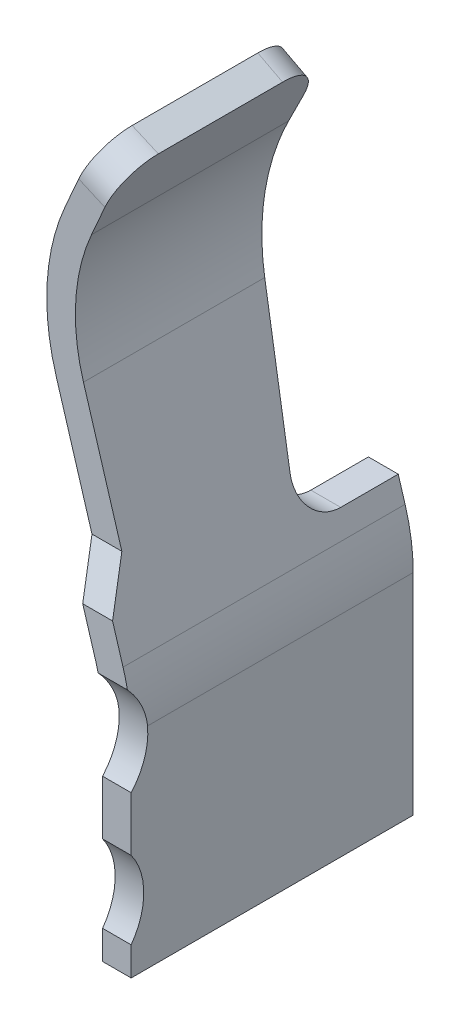
ISO-10303-21;
HEADER;
FILE_DESCRIPTION(('STEP AP214'),'2;1');
FILE_NAME('part.step','',(''),(''),'','','');
FILE_SCHEMA(('AUTOMOTIVE_DESIGN { 1 0 10303 214 1 1 1 1 }'));
ENDSEC;
DATA;
#1=APPLICATION_CONTEXT('core data for automotive mechanical design processes');
#2=APPLICATION_PROTOCOL_DEFINITION('international standard','automotive_design',2000,#1);
#3=PRODUCT_CONTEXT('',#1,'mechanical');
#4=PRODUCT('Part','Part','',(#3));
#5=PRODUCT_RELATED_PRODUCT_CATEGORY('part','',(#4));
#6=PRODUCT_DEFINITION_FORMATION('','',#4);
#7=PRODUCT_DEFINITION_CONTEXT('part definition',#1,'design');
#8=PRODUCT_DEFINITION('design','',#6,#7);
#9=PRODUCT_DEFINITION_SHAPE('','',#8);
#10=(LENGTH_UNIT() NAMED_UNIT(*) SI_UNIT(.MILLI.,.METRE.));
#11=(NAMED_UNIT(*) PLANE_ANGLE_UNIT() SI_UNIT($,.RADIAN.));
#12=(NAMED_UNIT(*) SI_UNIT($,.STERADIAN.) SOLID_ANGLE_UNIT());
#13=UNCERTAINTY_MEASURE_WITH_UNIT(LENGTH_MEASURE(1.E-05),#10,'distance_accuracy_value','');
#14=(GEOMETRIC_REPRESENTATION_CONTEXT(3) GLOBAL_UNCERTAINTY_ASSIGNED_CONTEXT((#13)) GLOBAL_UNIT_ASSIGNED_CONTEXT((#10,
#11,#12)) REPRESENTATION_CONTEXT('',''));
#15=CARTESIAN_POINT('',(0.,0.,0.));
#16=DIRECTION('',(0.,0.,1.));
#17=DIRECTION('',(1.,0.,0.));
#18=AXIS2_PLACEMENT_3D('',#15,#16,#17);
#19=CARTESIAN_POINT('',(1.87844493318108,3.52330708865174,0.423604352914839));
#20=DIRECTION('',(0.915327071470027,-0.402711251685503,0.));
#21=DIRECTION('',(0.402711251685503,0.915327071470027,0.));
#22=AXIS2_PLACEMENT_3D('',#19,#20,#21);
#23=CYLINDRICAL_SURFACE('',#22,0.2);
#24=CARTESIAN_POINT('',(1.87844493318108,3.52330708865174,0.423604352914839));
#25=DIRECTION('',(-0.915327071470028,0.4027112516855,0.));
#26=DIRECTION('',(0.4027112516855,0.915327071470028,0.));
#27=AXIS2_PLACEMENT_3D('',#24,#25,#26);
#28=CIRCLE('',#27,0.2);
#29=CARTESIAN_POINT('',(1.87844493318108,3.52330708865174,0.623604352914839));
#30=VERTEX_POINT('',#29);
#31=CARTESIAN_POINT('',(1.95898718351818,3.70637250294574,0.423604352914839));
#32=VERTEX_POINT('',#31);
#33=EDGE_CURVE('E527',#30,#32,#28,.T.);
#34=ORIENTED_EDGE('',*,*,#33,.F.);
#35=DIRECTION('',(-0.915327071470027,0.402711251685503,0.));
#36=VECTOR('',#35,1.);
#37=CARTESIAN_POINT('',(-22.7315059297134,14.3508073613119,0.623604352914805));
#38=LINE('',#37,#36);
#39=CARTESIAN_POINT('',(2.01574399390158,3.46290040089891,0.623604352914839));
#40=VERTEX_POINT('',#39);
#41=EDGE_CURVE('E27',#40,#30,#38,.T.);
#42=ORIENTED_EDGE('',*,*,#41,.F.);
#43=CARTESIAN_POINT('',(2.01574399390158,3.46290040089891,0.423604352914839));
#44=DIRECTION('',(0.915327071470028,-0.4027112516855,0.));
#45=DIRECTION('',(-0.402711251685501,-0.915327071470028,0.));
#46=AXIS2_PLACEMENT_3D('',#43,#44,#45);
#47=CIRCLE('',#46,0.2);
#48=CARTESIAN_POINT('',(2.09628624423868,3.64596581519291,0.423604352914839));
#49=VERTEX_POINT('',#48);
#50=EDGE_CURVE('E443',#49,#40,#47,.T.);
#51=ORIENTED_EDGE('',*,*,#50,.F.);
#52=DIRECTION('',(0.915327071470027,-0.402711251685503,0.));
#53=VECTOR('',#52,1.);
#54=CARTESIAN_POINT('',(1.95898718351818,3.70637250294574,0.423604352914839));
#55=LINE('',#54,#53);
#56=EDGE_CURVE('E492',#32,#49,#55,.T.);
#57=ORIENTED_EDGE('',*,*,#56,.F.);
#58=EDGE_LOOP('',(#34,#42,#51,#57));
#59=FACE_BOUND('',#58,.T.);
#60=ADVANCED_FACE('F16',(#59),#23,.T.);
#61=CARTESIAN_POINT('',(1.85613725867001,3.53312166947706,-0.236832722369337));
#62=DIRECTION('',(-0.914255270392898,0.402239697454473,-0.0483789866630451));
#63=DIRECTION('',(-0.402711251685503,-0.915327071470027,0.));
#64=AXIS2_PLACEMENT_3D('',#61,#62,#63);
#65=CYLINDRICAL_SURFACE('',#64,0.2);
#66=CARTESIAN_POINT('',(2.00694053804578,3.44289092405021,-0.427421697659668));
#67=CARTESIAN_POINT('',(2.05801746519236,3.55898426375477,-0.441384710680955));
#68=CARTESIAN_POINT('',(2.09628624423868,3.64596581519291,-0.356133634256613));
#69=CARTESIAN_POINT('',(2.09628624423868,3.64596581519291,-0.228386927890316));
#70=(BOUNDED_CURVE() B_SPLINE_CURVE(3,(#66,#67,#68,#69),.UNSPECIFIED.,.F.,
.F.) B_SPLINE_CURVE_WITH_KNOTS((4,4),(6.17366415670651,7.85398163397443),
.UNSPECIFIED.) CURVE() GEOMETRIC_REPRESENTATION_ITEM() RATIONAL_B_SPLINE_CURVE((1.,
0.77822974253387,0.77822974253387,1.)) REPRESENTATION_ITEM(''));
#71=CARTESIAN_POINT('',(2.00694053804578,3.44289092405021,-0.427421697659668));
#72=VERTEX_POINT('',#71);
#73=CARTESIAN_POINT('',(2.09628624423868,3.64596581519291,-0.228386927890316));
#74=VERTEX_POINT('',#73);
#75=EDGE_CURVE('E449',#72,#74,#70,.T.);
#76=ORIENTED_EDGE('',*,*,#75,.F.);
#77=DIRECTION('',(0.914255270392898,-0.402239697454473,0.0483789866630451));
#78=VECTOR('',#77,1.);
#79=CARTESIAN_POINT('',(-23.331852655037,14.5910558161891,-1.76825633941021));
#80=LINE('',#79,#78);
#81=CARTESIAN_POINT('',(1.86964147732527,3.50329761180303,-0.434687053017796));
#82=VERTEX_POINT('',#81);
#83=EDGE_CURVE('E11',#82,#72,#80,.T.);
#84=ORIENTED_EDGE('',*,*,#83,.F.);
#85=CARTESIAN_POINT('',(1.95898718351818,3.70637250294574,-0.235652283248443));
#86=CARTESIAN_POINT('',(1.95898718351818,3.70637250294574,-0.363398989614741));
#87=CARTESIAN_POINT('',(1.92071840447186,3.6193909515076,-0.448650066039083));
#88=CARTESIAN_POINT('',(1.86964147732527,3.50329761180303,-0.434687053017796));
#89=(BOUNDED_CURVE() B_SPLINE_CURVE(3,(#85,#86,#87,#88),.UNSPECIFIED.,.F.,
.F.) B_SPLINE_CURVE_WITH_KNOTS((4,4),(4.71238898038476,6.39270645765268),
.UNSPECIFIED.) CURVE() GEOMETRIC_REPRESENTATION_ITEM() RATIONAL_B_SPLINE_CURVE((1.,
0.77822974253387,0.77822974253387,1.)) REPRESENTATION_ITEM(''));
#90=CARTESIAN_POINT('',(1.95898718351818,3.70637250294574,-0.235652283248443));
#91=VERTEX_POINT('',#90);
#92=EDGE_CURVE('E499',#91,#82,#89,.T.);
#93=ORIENTED_EDGE('',*,*,#92,.F.);
#94=DIRECTION('',(-0.914255270392898,0.402239697454473,-0.0483789866630451));
#95=VECTOR('',#94,1.);
#96=CARTESIAN_POINT('',(1.93667950900712,3.71618708377106,-0.236832722369337));
#97=LINE('',#96,#95);
#98=EDGE_CURVE('E489',#74,#91,#97,.T.);
#99=ORIENTED_EDGE('',*,*,#98,.F.);
#100=EDGE_LOOP('',(#76,#84,#93,#99));
#101=FACE_BOUND('',#100,.T.);
#102=ADVANCED_FACE('F358',(#101),#65,.T.);
#103=CARTESIAN_POINT('',(-28.19,1.65634067151207,-0.212546111318104));
#104=DIRECTION('',(0.,-1.,0.));
#105=DIRECTION('',(0.,0.,-1.));
#106=AXIS2_PLACEMENT_3D('',#103,#104,#105);
#107=PLANE('',#106);
#108=DIRECTION('',(0.,0.,-1.));
#109=VECTOR('',#108,1.);
#110=CARTESIAN_POINT('',(2.03483507894154,1.65634067151207,-0.740000000000018));
#111=LINE('',#110,#109);
#112=CARTESIAN_POINT('',(2.03483507894154,1.65634067151207,-0.438042305987952));
#113=VERTEX_POINT('',#112);
#114=CARTESIAN_POINT('',(2.03483507894154,1.65634067151207,-0.740000000000018));
#115=VERTEX_POINT('',#114);
#116=EDGE_CURVE('E426',#113,#115,#111,.T.);
#117=ORIENTED_EDGE('',*,*,#116,.F.);
#118=DIRECTION('',(1.,0.,0.));
#119=VECTOR('',#118,1.);
#120=CARTESIAN_POINT('',(2.19150340910556,1.65634067151207,-0.438042305987951));
#121=LINE('',#120,#119);
#122=CARTESIAN_POINT('',(2.19150340910558,1.65634067151207,-0.438042305987951));
#123=VERTEX_POINT('',#122);
#124=EDGE_CURVE('E555',#113,#123,#121,.T.);
#125=ORIENTED_EDGE('',*,*,#124,.T.);
#126=DIRECTION('',(0.,0.,1.));
#127=VECTOR('',#126,1.);
#128=CARTESIAN_POINT('',(2.19150340910558,1.65634067151207,-0.740000000000018));
#129=LINE('',#128,#127);
#130=CARTESIAN_POINT('',(2.19150340910558,1.65634067151207,-0.740000000000018));
#131=VERTEX_POINT('',#130);
#132=EDGE_CURVE('E69',#131,#123,#129,.T.);
#133=ORIENTED_EDGE('',*,*,#132,.F.);
#134=DIRECTION('',(-1.,0.,0.));
#135=VECTOR('',#134,1.);
#136=CARTESIAN_POINT('',(1.27,1.65634067151207,-0.740000000000019));
#137=LINE('',#136,#135);
#138=EDGE_CURVE('E790',#131,#115,#137,.T.);
#139=ORIENTED_EDGE('',*,*,#138,.T.);
#140=EDGE_LOOP('',(#117,#125,#133,#139));
#141=FACE_BOUND('',#140,.T.);
#142=ADVANCED_FACE('F354',(#141),#107,.F.);
#143=CARTESIAN_POINT('',(-28.19,3.70637250294571,-0.459111687165995));
#144=DIRECTION('',(0.,0.119413416546905,0.992844618230162));
#145=DIRECTION('',(1.,0.,0.));
#146=AXIS2_PLACEMENT_3D('',#143,#144,#145);
#147=PLANE('',#146);
#148=DIRECTION('',(-0.28674853992682,0.951150986717314,-0.11439875574724));
#149=VECTOR('',#148,1.);
#150=CARTESIAN_POINT('',(2.2096639548885,1.59610175610151,-0.205300934614502));
#151=LINE('',#150,#149);
#152=CARTESIAN_POINT('',(2.12400830743362,1.88022335482146,-0.239473382341919));
#153=VERTEX_POINT('',#152);
#154=CARTESIAN_POINT('',(1.90341373590366,2.61194022573825,-0.327479914176621));
#155=VERTEX_POINT('',#154);
#156=EDGE_CURVE('E86',#153,#155,#151,.T.);
#157=ORIENTED_EDGE('',*,*,#156,.F.);
#158=DIRECTION('',(-1.,0.,0.));
#159=VECTOR('',#158,1.);
#160=CARTESIAN_POINT('',(2.03483507894153,1.88022335482146,-0.23947338234192));
#161=LINE('',#160,#159);
#162=CARTESIAN_POINT('',(1.96733997726958,1.88022335482146,-0.23947338234192));
#163=VERTEX_POINT('',#162);
#164=EDGE_CURVE('E285',#153,#163,#161,.T.);
#165=ORIENTED_EDGE('',*,*,#164,.T.);
#166=DIRECTION('',(0.286748539926818,-0.951150986717315,0.11439875574724));
#167=VECTOR('',#166,1.);
#168=CARTESIAN_POINT('',(2.06587763511194,1.55337185451571,-0.200161637444145));
#169=LINE('',#168,#167);
#170=CARTESIAN_POINT('',(1.75979823954622,2.56864369924933,-0.322272466749579));
#171=VERTEX_POINT('',#170);
#172=EDGE_CURVE('E706',#171,#163,#169,.T.);
#173=ORIENTED_EDGE('',*,*,#172,.F.);
#174=CARTESIAN_POINT('',(1.80822424609608,3.36370167510267,-0.417897288102545));
#175=CARTESIAN_POINT('',(1.69669920509327,3.11021511680704,-0.387409439934768));
#176=CARTESIAN_POINT('',(1.67986260540396,2.83379189253285,-0.354162906673266));
#177=CARTESIAN_POINT('',(1.75979823954622,2.56864369924933,-0.322272466749579));
#178=(BOUNDED_CURVE() B_SPLINE_CURVE(3,(#174,#175,#176,#177),.UNSPECIFIED.,.F.,
.F.) B_SPLINE_CURVE_WITH_KNOTS((4,4),(4.29791199977039,5.00519872138853),
.UNSPECIFIED.) CURVE() GEOMETRIC_REPRESENTATION_ITEM() RATIONAL_B_SPLINE_CURVE((1.,
0.958744787021091,0.958744787021091,1.)) REPRESENTATION_ITEM(''));
#179=CARTESIAN_POINT('',(1.80822424609608,3.36370167510267,-0.417897288102545));
#180=VERTEX_POINT('',#179);
#181=EDGE_CURVE('E189',#180,#171,#178,.T.);
#182=ORIENTED_EDGE('',*,*,#181,.F.);
#183=DIRECTION('',(-0.400292818236851,-0.909830186054405,0.109428936813832));
#184=VECTOR('',#183,1.);
#185=CARTESIAN_POINT('',(1.82233351008822,3.39577078475993,-0.421754368938234));
#186=LINE('',#185,#184);
#187=EDGE_CURVE('E503',#82,#180,#186,.T.);
#188=ORIENTED_EDGE('',*,*,#187,.F.);
#189=ORIENTED_EDGE('',*,*,#83,.T.);
#190=DIRECTION('',(0.400292818236852,0.909830186054405,-0.109428936813832));
#191=VECTOR('',#190,1.);
#192=CARTESIAN_POINT('',(1.95995081965593,3.33608744850051,-0.414576013974332));
#193=LINE('',#192,#191);
#194=CARTESIAN_POINT('',(1.94552330681659,3.30329498734983,-0.410631932744417));
#195=VERTEX_POINT('',#194);
#196=EDGE_CURVE('E521',#195,#72,#193,.T.);
#197=ORIENTED_EDGE('',*,*,#196,.F.);
#198=CARTESIAN_POINT('',(1.90341373590366,2.61194022573825,-0.327479914176621));
#199=CARTESIAN_POINT('',(1.83390448882343,2.84250387207174,-0.355210731501565));
#200=CARTESIAN_POINT('',(1.8485450102924,3.08287189317973,-0.384120760424611));
#201=CARTESIAN_POINT('',(1.94552330681659,3.30329498734983,-0.410631932744417));
#202=(BOUNDED_CURVE() B_SPLINE_CURVE(3,(#198,#199,#200,#201),.UNSPECIFIED.,.F.,
.F.) B_SPLINE_CURVE_WITH_KNOTS((4,4),(1.27798658579106,1.98527330740919),
.UNSPECIFIED.) CURVE() GEOMETRIC_REPRESENTATION_ITEM() RATIONAL_B_SPLINE_CURVE((1.,
0.958744787021091,0.958744787021091,1.)) REPRESENTATION_ITEM(''));
#203=EDGE_CURVE('E665',#155,#195,#202,.T.);
#204=ORIENTED_EDGE('',*,*,#203,.F.);
#205=EDGE_LOOP('',(#157,#165,#173,#182,#188,#189,#197,#204));
#206=FACE_BOUND('',#205,.T.);
#207=ADVANCED_FACE('F357',(#206),#147,.F.);
#208=CARTESIAN_POINT('',(-28.19,1.94413292378283,0.623604352914797));
#209=DIRECTION('',(0.,0.,-1.));
#210=DIRECTION('',(0.,-1.,0.));
#211=AXIS2_PLACEMENT_3D('',#208,#209,#210);
#212=PLANE('',#211);
#213=DIRECTION('',(-0.402711251685501,-0.915327071470028,0.));
#214=VECTOR('',#213,1.);
#215=CARTESIAN_POINT('',(1.94552330681658,3.30329498734984,0.623604352914839));
#216=LINE('',#215,#214);
#217=CARTESIAN_POINT('',(1.94552330681659,3.30329498734984,0.623604352914839));
#218=VERTEX_POINT('',#217);
#219=EDGE_CURVE('E448',#40,#218,#216,.T.);
#220=ORIENTED_EDGE('',*,*,#219,.F.);
#221=ORIENTED_EDGE('',*,*,#41,.T.);
#222=DIRECTION('',(0.4027112516855,0.915327071470028,0.));
#223=VECTOR('',#222,1.);
#224=CARTESIAN_POINT('',(1.80822424609608,3.36370167510267,0.623604352914839));
#225=LINE('',#224,#223);
#226=CARTESIAN_POINT('',(1.80822424609608,3.36370167510267,0.623604352914839));
#227=VERTEX_POINT('',#226);
#228=EDGE_CURVE('E531',#227,#30,#225,.T.);
#229=ORIENTED_EDGE('',*,*,#228,.F.);
#230=CARTESIAN_POINT('',(2.86085037828661,2.90058373566433,0.62360435291484));
#231=DIRECTION('',(0.,0.,-1.));
#232=DIRECTION('',(-1.,0.,0.));
#233=AXIS2_PLACEMENT_3D('',#230,#231,#232);
#234=CIRCLE('',#233,1.15);
#235=CARTESIAN_POINT('',(1.75979823954622,2.56864369924933,0.623604352914839));
#236=VERTEX_POINT('',#235);
#237=EDGE_CURVE('E512',#236,#227,#234,.T.);
#238=ORIENTED_EDGE('',*,*,#237,.F.);
#239=DIRECTION('',(-0.288643509926088,0.957436642382956,0.));
#240=VECTOR('',#239,1.);
#241=CARTESIAN_POINT('',(2.08382114602551,1.49385284836845,0.623604352914839));
#242=LINE('',#241,#240);
#243=CARTESIAN_POINT('',(1.94807282006432,1.94413292378283,0.623604352914839));
#244=VERTEX_POINT('',#243);
#245=EDGE_CURVE('E476',#244,#236,#242,.T.);
#246=ORIENTED_EDGE('',*,*,#245,.F.);
#247=DIRECTION('',(1.,0.,0.));
#248=VECTOR('',#247,1.);
#249=CARTESIAN_POINT('',(-28.19,1.94413292378283,0.623604352914797));
#250=LINE('',#249,#248);
#251=CARTESIAN_POINT('',(2.10474115022836,1.94413292378283,0.623604352914839));
#252=VERTEX_POINT('',#251);
#253=EDGE_CURVE('E634',#244,#252,#250,.T.);
#254=ORIENTED_EDGE('',*,*,#253,.T.);
#255=DIRECTION('',(0.28864350992609,-0.957436642382956,0.));
#256=VECTOR('',#255,1.);
#257=CARTESIAN_POINT('',(2.22743664238295,1.53714937485737,0.623604352914839));
#258=LINE('',#257,#256);
#259=CARTESIAN_POINT('',(1.90341373590365,2.61194022573825,0.623604352914839));
#260=VERTEX_POINT('',#259);
#261=EDGE_CURVE('E567',#260,#252,#258,.T.);
#262=ORIENTED_EDGE('',*,*,#261,.F.);
#263=CARTESIAN_POINT('',(2.86085037828661,2.90058373566433,0.62360435291484));
#264=DIRECTION('',(0.,0.,1.));
#265=DIRECTION('',(-1.,0.,0.));
#266=AXIS2_PLACEMENT_3D('',#263,#264,#265);
#267=CIRCLE('',#266,1.);
#268=EDGE_CURVE('E640',#218,#260,#267,.T.);
#269=ORIENTED_EDGE('',*,*,#268,.F.);
#270=EDGE_LOOP('',(#220,#221,#229,#238,#246,#254,#262,#269));
#271=FACE_BOUND('',#270,.T.);
#272=ADVANCED_FACE('F984',(#271),#212,.F.);
#273=CARTESIAN_POINT('',(-28.19,1.7003498353216,0.749999999999972));
#274=DIRECTION('',(0.,-0.460287319631494,-0.887770005906065));
#275=DIRECTION('',(0.,-0.887770005906065,0.460287319631494));
#276=AXIS2_PLACEMENT_3D('',#273,#274,#275);
#277=PLANE('',#276);
#278=DIRECTION('',(-1.,0.,0.));
#279=VECTOR('',#278,1.);
#280=CARTESIAN_POINT('',(1.27,1.7196371362757,0.739999999999981));
#281=LINE('',#280,#279);
#282=CARTESIAN_POINT('',(2.17242108767926,1.7196371362757,0.739999999999982));
#283=VERTEX_POINT('',#282);
#284=CARTESIAN_POINT('',(2.01575275751522,1.7196371362757,0.739999999999982));
#285=VERTEX_POINT('',#284);
#286=EDGE_CURVE('E587',#283,#285,#281,.T.);
#287=ORIENTED_EDGE('',*,*,#286,.F.);
#288=DIRECTION('',(0.258541028225372,-0.857586072334425,0.444637678635293));
#289=VECTOR('',#288,1.);
#290=CARTESIAN_POINT('',(2.04642343830643,2.13757401070795,0.523309818502748));
#291=LINE('',#290,#289);
#292=EDGE_CURVE('E564',#252,#283,#291,.T.);
#293=ORIENTED_EDGE('',*,*,#292,.F.);
#294=ORIENTED_EDGE('',*,*,#253,.F.);
#295=DIRECTION('',(-0.258541028225371,0.857586072334425,-0.444637678635293));
#296=VECTOR('',#295,1.);
#297=CARTESIAN_POINT('',(1.9002273619162,2.10283732290249,0.541319952677684));
#298=LINE('',#297,#296);
#299=EDGE_CURVE('E471',#285,#244,#298,.T.);
#300=ORIENTED_EDGE('',*,*,#299,.F.);
#301=EDGE_LOOP('',(#287,#293,#294,#300));
#302=FACE_BOUND('',#301,.T.);
#303=ADVANCED_FACE('F352',(#302),#277,.F.);
#304=CARTESIAN_POINT('',(1.27,1.24850586493128,0.739999999999981));
#305=DIRECTION('',(0.,0.,-1.));
#306=DIRECTION('',(0.,-1.,0.));
#307=AXIS2_PLACEMENT_3D('',#304,#305,#306);
#308=PLANE('',#307);
#309=DIRECTION('',(0.,-1.,0.));
#310=VECTOR('',#309,1.);
#311=CARTESIAN_POINT('',(2.27,0.145965815192914,0.739999999999982));
#312=LINE('',#311,#310);
#313=CARTESIAN_POINT('',(2.27,0.296740599868486,0.739999999999982));
#314=VERTEX_POINT('',#313);
#315=CARTESIAN_POINT('',(2.27,0.145965815192914,0.739999999999982));
#316=VERTEX_POINT('',#315);
#317=EDGE_CURVE('E725',#314,#316,#312,.T.);
#318=ORIENTED_EDGE('',*,*,#317,.F.);
#319=DIRECTION('',(-1.,0.,0.));
#320=VECTOR('',#319,1.);
#321=CARTESIAN_POINT('',(-28.19,0.296740599868486,0.73999999999994));
#322=LINE('',#321,#320);
#323=CARTESIAN_POINT('',(2.12,0.296740599868486,0.739999999999982));
#324=VERTEX_POINT('',#323);
#325=EDGE_CURVE('E467',#314,#324,#322,.T.);
#326=ORIENTED_EDGE('',*,*,#325,.T.);
#327=DIRECTION('',(0.,1.,0.));
#328=VECTOR('',#327,1.);
#329=CARTESIAN_POINT('',(2.12,0.145965815192914,0.739999999999982));
#330=LINE('',#329,#328);
#331=CARTESIAN_POINT('',(2.12,0.145965815192914,0.739999999999982));
#332=VERTEX_POINT('',#331);
#333=EDGE_CURVE('E618',#332,#324,#330,.T.);
#334=ORIENTED_EDGE('',*,*,#333,.F.);
#335=DIRECTION('',(-1.,0.,0.));
#336=VECTOR('',#335,1.);
#337=CARTESIAN_POINT('',(2.12,0.145965815192914,0.739999999999982));
#338=LINE('',#337,#336);
#339=EDGE_CURVE('E266',#316,#332,#338,.T.);
#340=ORIENTED_EDGE('',*,*,#339,.F.);
#341=EDGE_LOOP('',(#318,#326,#334,#340));
#342=FACE_BOUND('',#341,.T.);
#343=ADVANCED_FACE('F348',(#342),#308,.F.);
#344=CARTESIAN_POINT('',(1.27,1.24850586493128,-0.740000000000019));
#345=DIRECTION('',(0.,0.,-1.));
#346=DIRECTION('',(0.,-1.,0.));
#347=AXIS2_PLACEMENT_3D('',#344,#345,#346);
#348=PLANE('',#347);
#349=ORIENTED_EDGE('',*,*,#138,.F.);
#350=DIRECTION('',(0.28864350992609,-0.957436642382956,0.));
#351=VECTOR('',#350,1.);
#352=CARTESIAN_POINT('',(2.22743664238295,1.53714937485737,-0.740000000000018));
#353=LINE('',#352,#351);
#354=CARTESIAN_POINT('',(2.22743664238295,1.53714937485737,-0.740000000000018));
#355=VERTEX_POINT('',#354);
#356=EDGE_CURVE('E575',#131,#355,#353,.T.);
#357=ORIENTED_EDGE('',*,*,#356,.T.);
#358=CARTESIAN_POINT('',(1.27,1.24850586493128,-0.740000000000019));
#359=DIRECTION('',(0.,0.,-1.));
#360=DIRECTION('',(-1.,0.,0.));
#361=AXIS2_PLACEMENT_3D('',#358,#359,#360);
#362=CIRCLE('',#361,1.);
#363=CARTESIAN_POINT('',(2.27,1.24850586493128,-0.740000000000018));
#364=VERTEX_POINT('',#363);
#365=EDGE_CURVE('E407',#355,#364,#362,.T.);
#366=ORIENTED_EDGE('',*,*,#365,.T.);
#367=DIRECTION('',(0.,-1.,0.));
#368=VECTOR('',#367,1.);
#369=CARTESIAN_POINT('',(2.27,0.145965815192914,-0.740000000000018));
#370=LINE('',#369,#368);
#371=CARTESIAN_POINT('',(2.27,0.145965815192914,-0.740000000000018));
#372=VERTEX_POINT('',#371);
#373=EDGE_CURVE('E42',#364,#372,#370,.T.);
#374=ORIENTED_EDGE('',*,*,#373,.T.);
#375=DIRECTION('',(-1.,0.,0.));
#376=VECTOR('',#375,1.);
#377=CARTESIAN_POINT('',(2.12,0.145965815192914,-0.740000000000018));
#378=LINE('',#377,#376);
#379=CARTESIAN_POINT('',(2.12,0.145965815192914,-0.740000000000018));
#380=VERTEX_POINT('',#379);
#381=EDGE_CURVE('E769',#372,#380,#378,.T.);
#382=ORIENTED_EDGE('',*,*,#381,.T.);
#383=DIRECTION('',(0.,1.,0.));
#384=VECTOR('',#383,1.);
#385=CARTESIAN_POINT('',(2.12,0.145965815192914,-0.740000000000018));
#386=LINE('',#385,#384);
#387=CARTESIAN_POINT('',(2.12,1.24850586493128,-0.740000000000018));
#388=VERTEX_POINT('',#387);
#389=EDGE_CURVE('E626',#380,#388,#386,.T.);
#390=ORIENTED_EDGE('',*,*,#389,.T.);
#391=CARTESIAN_POINT('',(1.27,1.24850586493128,-0.740000000000019));
#392=DIRECTION('',(0.,0.,1.));
#393=DIRECTION('',(-1.,0.,0.));
#394=AXIS2_PLACEMENT_3D('',#391,#392,#393);
#395=CIRCLE('',#394,0.85);
#396=CARTESIAN_POINT('',(2.08382114602552,1.49385284836845,-0.740000000000018));
#397=VERTEX_POINT('',#396);
#398=EDGE_CURVE('E617',#388,#397,#395,.T.);
#399=ORIENTED_EDGE('',*,*,#398,.T.);
#400=DIRECTION('',(-0.288643509926088,0.957436642382956,0.));
#401=VECTOR('',#400,1.);
#402=CARTESIAN_POINT('',(2.08382114602552,1.49385284836845,-0.740000000000018));
#403=LINE('',#402,#401);
#404=EDGE_CURVE('E204',#397,#115,#403,.T.);
#405=ORIENTED_EDGE('',*,*,#404,.T.);
#406=EDGE_LOOP('',(#349,#357,#366,#374,#382,#390,#399,#405));
#407=FACE_BOUND('',#406,.T.);
#408=ADVANCED_FACE('F351',(#407),#348,.T.);
#409=CARTESIAN_POINT('',(2.27,0.145965815192914,-0.740000000000018));
#410=DIRECTION('',(-1.,0.,0.));
#411=DIRECTION('',(0.,0.,1.));
#412=AXIS2_PLACEMENT_3D('',#409,#410,#411);
#413=PLANE('',#412);
#414=DIRECTION('',(0.,0.,1.));
#415=VECTOR('',#414,1.);
#416=CARTESIAN_POINT('',(2.27,1.24850586493128,-0.740000000000018));
#417=LINE('',#416,#415);
#418=CARTESIAN_POINT('',(2.27,1.24850586493128,0.654029100989327));
#419=VERTEX_POINT('',#418);
#420=EDGE_CURVE('E404',#364,#419,#417,.T.);
#421=ORIENTED_EDGE('',*,*,#420,.T.);
#422=CARTESIAN_POINT('',(2.27,1.21669179396546,0.995153761033099));
#423=DIRECTION('',(1.,0.,0.));
#424=DIRECTION('',(0.,0.,1.));
#425=AXIS2_PLACEMENT_3D('',#422,#423,#424);
#426=CIRCLE('',#425,0.342604974863759);
#427=CARTESIAN_POINT('',(2.27,0.988055123608201,0.739999999999982));
#428=VERTEX_POINT('',#427);
#429=EDGE_CURVE('E276',#428,#419,#426,.T.);
#430=ORIENTED_EDGE('',*,*,#429,.F.);
#431=DIRECTION('',(0.,-1.,0.));
#432=VECTOR('',#431,1.);
#433=CARTESIAN_POINT('',(2.27,0.145965815192914,0.739999999999982));
#434=LINE('',#433,#432);
#435=CARTESIAN_POINT('',(2.27,0.703259400131467,0.739999999999982));
#436=VERTEX_POINT('',#435);
#437=EDGE_CURVE('E267',#428,#436,#434,.T.);
#438=ORIENTED_EDGE('',*,*,#437,.T.);
#439=CARTESIAN_POINT('',(2.27,0.499999999999977,1.01942683457021));
#440=DIRECTION('',(1.,0.,0.));
#441=DIRECTION('',(0.,0.,1.));
#442=AXIS2_PLACEMENT_3D('',#439,#440,#441);
#443=CIRCLE('',#442,0.345533991988848);
#444=EDGE_CURVE('E676',#314,#436,#443,.T.);
#445=ORIENTED_EDGE('',*,*,#444,.F.);
#446=ORIENTED_EDGE('',*,*,#317,.T.);
#447=DIRECTION('',(0.,0.,1.));
#448=VECTOR('',#447,1.);
#449=CARTESIAN_POINT('',(2.27,0.145965815192914,-0.740000000000018));
#450=LINE('',#449,#448);
#451=EDGE_CURVE('E650',#372,#316,#450,.T.);
#452=ORIENTED_EDGE('',*,*,#451,.F.);
#453=ORIENTED_EDGE('',*,*,#373,.F.);
#454=EDGE_LOOP('',(#421,#430,#438,#445,#446,#452,#453));
#455=FACE_BOUND('',#454,.T.);
#456=ADVANCED_FACE('F335',(#455),#413,.F.);
#457=CARTESIAN_POINT('',(1.27,1.24850586493128,-0.740000000000019));
#458=DIRECTION('',(0.,0.,1.));
#459=DIRECTION('',(1.,0.,0.));
#460=AXIS2_PLACEMENT_3D('',#457,#458,#459);
#461=CYLINDRICAL_SURFACE('',#460,1.);
#462=CARTESIAN_POINT('',(1.27,1.24850586493128,0.739999999999981));
#463=DIRECTION('',(0.,0.,-1.));
#464=DIRECTION('',(-1.,0.,0.));
#465=AXIS2_PLACEMENT_3D('',#462,#463,#464);
#466=CIRCLE('',#465,1.);
#467=CARTESIAN_POINT('',(2.22743664238295,1.53714937485737,0.739999999999982));
#468=VERTEX_POINT('',#467);
#469=CARTESIAN_POINT('',(2.25043911813473,1.44532846432271,0.739999999999982));
#470=VERTEX_POINT('',#469);
#471=EDGE_CURVE('E304',#468,#470,#466,.T.);
#472=ORIENTED_EDGE('',*,*,#471,.T.);
#473=CARTESIAN_POINT('',(2.25043911813472,1.44532846432271,0.739999999999982));
#474=CARTESIAN_POINT('',(2.25112131741684,1.4419302471742,0.73695469854553));
#475=CARTESIAN_POINT('',(2.25179721850849,1.43847176034271,0.733975045899739));
#476=CARTESIAN_POINT('',(2.25312855952597,1.43145643098173,0.728168909339999));
#477=CARTESIAN_POINT('',(2.25378408931622,1.4279002110217,0.725341693611933));
#478=CARTESIAN_POINT('',(2.25507168816971,1.42068928784964,0.719840380711266));
#479=CARTESIAN_POINT('',(2.25570383827922,1.41703501951599,0.717165732805619));
#480=CARTESIAN_POINT('',(2.25694157212656,1.40962817005629,0.711969336935426));
#481=CARTESIAN_POINT('',(2.25754721552127,1.40587584366131,0.709447240161887));
#482=CARTESIAN_POINT('',(2.25872877129684,1.39827302810716,0.704555749407427));
#483=CARTESIAN_POINT('',(2.25930470888845,1.39442262647144,0.702186225502017));
#484=CARTESIAN_POINT('',(2.26042361722597,1.38662388081515,0.697599649617423));
#485=CARTESIAN_POINT('',(2.26096656581678,1.38267547342769,0.695382699975889));
#486=CARTESIAN_POINT('',(2.26201619604994,1.37468096295907,0.691101059928249));
#487=CARTESIAN_POINT('',(2.26252279573885,1.37063466501779,0.689036713287359));
#488=CARTESIAN_POINT('',(2.26349635159397,1.36244473872741,0.68505995514894));
#489=CARTESIAN_POINT('',(2.26396315439605,1.35830080604152,0.683148133100331));
#490=CARTESIAN_POINT('',(2.26485385101726,1.34991442649092,0.679475891500464));
#491=CARTESIAN_POINT('',(2.26527749507101,1.34567156354334,0.677716361222175));
#492=CARTESIAN_POINT('',(2.26607352805792,1.33713872195234,0.67437603386879));
#493=CARTESIAN_POINT('',(2.26644618935101,1.33284913740293,0.672794295796545));
#494=CARTESIAN_POINT('',(2.2671386385479,1.32422362544513,0.669809238507272));
#495=CARTESIAN_POINT('',(2.26745863414993,1.31988795555454,0.668405223722643));
#496=CARTESIAN_POINT('',(2.2680441441101,1.31117101253282,0.665775382478383));
#497=CARTESIAN_POINT('',(2.26830979142467,1.30678987892417,0.664549123358667));
#498=CARTESIAN_POINT('',(2.26878499367845,1.29798278695432,0.662274523841798));
#499=CARTESIAN_POINT('',(2.26899459796071,1.29355687160879,0.661226027233404));
#500=CARTESIAN_POINT('',(2.26935611224075,1.28466100981404,0.659306657193431));
#501=CARTESIAN_POINT('',(2.26950798054882,1.2801910339301,0.658435912321234));
#502=CARTESIAN_POINT('',(2.26975239151872,1.27120787033449,0.656871822149803));
#503=CARTESIAN_POINT('',(2.26984479570127,1.2666946064207,0.656178893183976));
#504=CARTESIAN_POINT('',(2.26996875637607,1.25762568522588,0.654969909316697));
#505=CARTESIAN_POINT('',(2.27000007412201,1.2530699312534,0.654454554866675));
#506=CARTESIAN_POINT('',(2.27,1.24850586493128,0.654029100989326));
#507=B_SPLINE_CURVE_WITH_KNOTS('',3,(#473,#474,#475,#476,#477,#478,#479,#480,#481,#482,#483,
#484,#485,#486,#487,#488,#489,#490,#491,#492,#493,#494,#495,#496,#497,#498,#499,#500,#501,#502,
#503,#504,#505,#506),.UNSPECIFIED.,.F.,.F.,(4,2,2,2,2,2,2,2,2,2,2,2,2,2,2,2,4),(0.,
0.0138407212060805,0.0276076629968661,0.0413212735158606,0.0550022400250797,0.0686713979827876,
0.0823496367918205,0.0960578043228291,0.109816612381096,0.123650992268955,0.13740831096958,
0.151110002599385,0.164777762982645,0.178433449670149,0.192098978145328,0.205796216649424,
0.219546882133365),.UNSPECIFIED.);
#508=EDGE_CURVE('E312',#470,#419,#507,.T.);
#509=ORIENTED_EDGE('',*,*,#508,.T.);
#510=ORIENTED_EDGE('',*,*,#420,.F.);
#511=ORIENTED_EDGE('',*,*,#365,.F.);
#512=DIRECTION('',(0.,0.,1.));
#513=VECTOR('',#512,1.);
#514=CARTESIAN_POINT('',(2.22743664238295,1.53714937485737,-0.740000000000018));
#515=LINE('',#514,#513);
#516=EDGE_CURVE('E408',#355,#468,#515,.T.);
#517=ORIENTED_EDGE('',*,*,#516,.T.);
#518=EDGE_LOOP('',(#472,#509,#510,#511,#517));
#519=FACE_BOUND('',#518,.T.);
#520=ADVANCED_FACE('F325',(#519),#461,.T.);
#521=CARTESIAN_POINT('',(2.22743664238295,1.53714937485737,-0.740000000000018));
#522=DIRECTION('',(-0.957436642382956,-0.28864350992609,0.));
#523=DIRECTION('',(-0.28864350992609,0.957436642382956,0.));
#524=AXIS2_PLACEMENT_3D('',#521,#522,#523);
#525=PLANE('',#524);
#526=ORIENTED_EDGE('',*,*,#356,.F.);
#527=ORIENTED_EDGE('',*,*,#132,.T.);
#528=CARTESIAN_POINT('',(2.19150340910558,1.65634067151207,-0.438042305987951));
#529=CARTESIAN_POINT('',(2.19150340910558,1.65634067151208,-0.320885018462571));
#530=CARTESIAN_POINT('',(2.16652837656353,1.73918338398669,-0.238042305987951));
#531=CARTESIAN_POINT('',(2.13120834682183,1.85634067151208,-0.238042305987952));
#532=(BOUNDED_CURVE() B_SPLINE_CURVE(3,(#528,#529,#530,#531),.UNSPECIFIED.,.F.,
.F.) B_SPLINE_CURVE_WITH_KNOTS((4,4),(3.1415926535898,4.71238898038469),
.UNSPECIFIED.) CURVE() GEOMETRIC_REPRESENTATION_ITEM() RATIONAL_B_SPLINE_CURVE((1.,
0.804737854124365,0.804737854124365,1.)) REPRESENTATION_ITEM(''));
#533=CARTESIAN_POINT('',(2.13120834682183,1.85634067151208,-0.238042305987952));
#534=VERTEX_POINT('',#533);
#535=EDGE_CURVE('E559',#123,#534,#532,.T.);
#536=ORIENTED_EDGE('',*,*,#535,.T.);
#537=CARTESIAN_POINT('',(2.13120834682183,1.85634067151208,-0.238042305987952));
#538=CARTESIAN_POINT('',(2.12880115558452,1.86432537588468,-0.238042305987952));
#539=CARTESIAN_POINT('',(2.12639827429865,1.87229578405696,-0.23851990151267));
#540=CARTESIAN_POINT('',(2.12400830743362,1.88022335482146,-0.239473382341919));
#541=(BOUNDED_CURVE() B_SPLINE_CURVE(3,(#537,#538,#539,#540),.UNSPECIFIED.,.F.,
.F.) B_SPLINE_CURVE_WITH_KNOTS((4,4),(4.71238898038469,4.83208803082147),
.UNSPECIFIED.) CURVE() GEOMETRIC_REPRESENTATION_ITEM() RATIONAL_B_SPLINE_CURVE((1.,
0.998806367803328,0.998806367803328,1.)) REPRESENTATION_ITEM(''));
#542=EDGE_CURVE('E594',#534,#153,#541,.T.);
#543=ORIENTED_EDGE('',*,*,#542,.T.);
#544=ORIENTED_EDGE('',*,*,#156,.T.);
#545=DIRECTION('',(0.,0.,1.));
#546=VECTOR('',#545,1.);
#547=CARTESIAN_POINT('',(1.90341373590366,2.61194022573825,-0.740000000000018));
#548=LINE('',#547,#546);
#549=EDGE_CURVE('E660',#155,#260,#548,.T.);
#550=ORIENTED_EDGE('',*,*,#549,.T.);
#551=ORIENTED_EDGE('',*,*,#261,.T.);
#552=ORIENTED_EDGE('',*,*,#292,.T.);
#553=DIRECTION('',(0.28864350992609,-0.957436642382956,0.));
#554=VECTOR('',#553,1.);
#555=CARTESIAN_POINT('',(2.22743664238295,1.53714937485737,0.739999999999982));
#556=LINE('',#555,#554);
#557=EDGE_CURVE('E652',#283,#468,#556,.T.);
#558=ORIENTED_EDGE('',*,*,#557,.T.);
#559=ORIENTED_EDGE('',*,*,#516,.F.);
#560=EDGE_LOOP('',(#526,#527,#536,#543,#544,#550,#551,#552,#558,#559));
#561=FACE_BOUND('',#560,.T.);
#562=ADVANCED_FACE('F18',(#561),#525,.F.);
#563=CARTESIAN_POINT('',(2.86085037828662,2.90058373566433,-0.740000000000017));
#564=DIRECTION('',(0.,0.,1.));
#565=DIRECTION('',(1.,0.,0.));
#566=AXIS2_PLACEMENT_3D('',#563,#564,#565);
#567=CYLINDRICAL_SURFACE('',#566,1.);
#568=ORIENTED_EDGE('',*,*,#549,.F.);
#569=ORIENTED_EDGE('',*,*,#203,.T.);
#570=DIRECTION('',(0.,0.,1.));
#571=VECTOR('',#570,1.);
#572=CARTESIAN_POINT('',(1.94552330681659,3.30329498734983,-0.740000000000018));
#573=LINE('',#572,#571);
#574=EDGE_CURVE('E459',#195,#218,#573,.T.);
#575=ORIENTED_EDGE('',*,*,#574,.T.);
#576=ORIENTED_EDGE('',*,*,#268,.T.);
#577=EDGE_LOOP('',(#568,#569,#575,#576));
#578=FACE_BOUND('',#577,.T.);
#579=ADVANCED_FACE('F344',(#578),#567,.F.);
#580=CARTESIAN_POINT('',(1.94552330681659,3.30329498734984,-0.740000000000018));
#581=DIRECTION('',(-0.915327071470028,0.402711251685501,0.));
#582=DIRECTION('',(0.,0.,1.));
#583=AXIS2_PLACEMENT_3D('',#580,#581,#582);
#584=PLANE('',#583);
#585=ORIENTED_EDGE('',*,*,#196,.T.);
#586=ORIENTED_EDGE('',*,*,#75,.T.);
#587=DIRECTION('',(0.,0.,1.));
#588=VECTOR('',#587,1.);
#589=CARTESIAN_POINT('',(2.09628624423868,3.64596581519291,-0.740000000000018));
#590=LINE('',#589,#588);
#591=EDGE_CURVE('E493',#74,#49,#590,.T.);
#592=ORIENTED_EDGE('',*,*,#591,.T.);
#593=ORIENTED_EDGE('',*,*,#50,.T.);
#594=ORIENTED_EDGE('',*,*,#219,.T.);
#595=ORIENTED_EDGE('',*,*,#574,.F.);
#596=EDGE_LOOP('',(#585,#586,#592,#593,#594,#595));
#597=FACE_BOUND('',#596,.T.);
#598=ADVANCED_FACE('F342',(#597),#584,.F.);
#599=CARTESIAN_POINT('',(1.95898718351818,3.70637250294574,-0.740000000000018));
#600=DIRECTION('',(-0.402711251685503,-0.915327071470027,0.));
#601=DIRECTION('',(-0.915327071470027,0.402711251685503,0.));
#602=AXIS2_PLACEMENT_3D('',#599,#600,#601);
#603=PLANE('',#602);
#604=ORIENTED_EDGE('',*,*,#591,.F.);
#605=ORIENTED_EDGE('',*,*,#98,.T.);
#606=DIRECTION('',(0.,0.,1.));
#607=VECTOR('',#606,1.);
#608=CARTESIAN_POINT('',(1.95898718351818,3.70637250294574,-0.740000000000018));
#609=LINE('',#608,#607);
#610=EDGE_CURVE('E504',#91,#32,#609,.T.);
#611=ORIENTED_EDGE('',*,*,#610,.T.);
#612=ORIENTED_EDGE('',*,*,#56,.T.);
#613=EDGE_LOOP('',(#604,#605,#611,#612));
#614=FACE_BOUND('',#613,.T.);
#615=ADVANCED_FACE('F338',(#614),#603,.F.);
#616=CARTESIAN_POINT('',(1.80822424609608,3.36370167510267,-0.740000000000018));
#617=DIRECTION('',(0.915327071470028,-0.4027112516855,0.));
#618=DIRECTION('',(0.,0.,-1.));
#619=AXIS2_PLACEMENT_3D('',#616,#617,#618);
#620=PLANE('',#619);
#621=ORIENTED_EDGE('',*,*,#610,.F.);
#622=ORIENTED_EDGE('',*,*,#92,.T.);
#623=ORIENTED_EDGE('',*,*,#187,.T.);
#624=DIRECTION('',(0.,0.,1.));
#625=VECTOR('',#624,1.);
#626=CARTESIAN_POINT('',(1.80822424609608,3.36370167510267,-0.740000000000018));
#627=LINE('',#626,#625);
#628=EDGE_CURVE('E429',#180,#227,#627,.T.);
#629=ORIENTED_EDGE('',*,*,#628,.T.);
#630=ORIENTED_EDGE('',*,*,#228,.T.);
#631=ORIENTED_EDGE('',*,*,#33,.T.);
#632=EDGE_LOOP('',(#621,#622,#623,#629,#630,#631));
#633=FACE_BOUND('',#632,.T.);
#634=ADVANCED_FACE('F341',(#633),#620,.F.);
#635=CARTESIAN_POINT('',(2.86085037828662,2.90058373566433,-0.740000000000017));
#636=DIRECTION('',(0.,0.,1.));
#637=DIRECTION('',(1.,0.,0.));
#638=AXIS2_PLACEMENT_3D('',#635,#636,#637);
#639=CYLINDRICAL_SURFACE('',#638,1.15);
#640=ORIENTED_EDGE('',*,*,#628,.F.);
#641=ORIENTED_EDGE('',*,*,#181,.T.);
#642=DIRECTION('',(0.,0.,1.));
#643=VECTOR('',#642,1.);
#644=CARTESIAN_POINT('',(1.75979823954622,2.56864369924933,-0.740000000000019));
#645=LINE('',#644,#643);
#646=EDGE_CURVE('E433',#171,#236,#645,.T.);
#647=ORIENTED_EDGE('',*,*,#646,.T.);
#648=ORIENTED_EDGE('',*,*,#237,.T.);
#649=EDGE_LOOP('',(#640,#641,#647,#648));
#650=FACE_BOUND('',#649,.T.);
#651=ADVANCED_FACE('F987',(#650),#639,.T.);
#652=CARTESIAN_POINT('',(2.08382114602552,1.49385284836845,-0.740000000000018));
#653=DIRECTION('',(0.957436642382956,0.288643509926088,0.));
#654=DIRECTION('',(0.,0.,-1.));
#655=AXIS2_PLACEMENT_3D('',#652,#653,#654);
#656=PLANE('',#655);
#657=ORIENTED_EDGE('',*,*,#172,.T.);
#658=CARTESIAN_POINT('',(1.96733997726958,1.88022335482146,-0.23947338234192));
#659=CARTESIAN_POINT('',(1.96972994413461,1.87229578405696,-0.23851990151267));
#660=CARTESIAN_POINT('',(1.97213282542048,1.86432537588468,-0.238042305987952));
#661=CARTESIAN_POINT('',(1.9745400166578,1.85634067151208,-0.238042305987952));
#662=(BOUNDED_CURVE() B_SPLINE_CURVE(3,(#658,#659,#660,#661),.UNSPECIFIED.,.F.,
.F.) B_SPLINE_CURVE_WITH_KNOTS((4,4),(1.45109727635811,1.5707963267949),
.UNSPECIFIED.) CURVE() GEOMETRIC_REPRESENTATION_ITEM() RATIONAL_B_SPLINE_CURVE((1.,
0.998806367803328,0.998806367803328,1.)) REPRESENTATION_ITEM(''));
#663=CARTESIAN_POINT('',(1.9745400166578,1.85634067151208,-0.238042305987952));
#664=VERTEX_POINT('',#663);
#665=EDGE_CURVE('E292',#163,#664,#662,.T.);
#666=ORIENTED_EDGE('',*,*,#665,.T.);
#667=CARTESIAN_POINT('',(1.9745400166578,1.85634067151208,-0.238042305987952));
#668=CARTESIAN_POINT('',(2.00986004639948,1.73918338398669,-0.238042305987952));
#669=CARTESIAN_POINT('',(2.03483507894154,1.65634067151208,-0.320885018462571));
#670=CARTESIAN_POINT('',(2.03483507894154,1.65634067151207,-0.438042305987952));
#671=(BOUNDED_CURVE() B_SPLINE_CURVE(3,(#667,#668,#669,#670),.UNSPECIFIED.,.F.,
.F.) B_SPLINE_CURVE_WITH_KNOTS((4,4),(1.5707963267949,3.1415926535898),
.UNSPECIFIED.) CURVE() GEOMETRIC_REPRESENTATION_ITEM() RATIONAL_B_SPLINE_CURVE((1.,
0.804737854124365,0.804737854124365,1.)) REPRESENTATION_ITEM(''));
#672=EDGE_CURVE('E558',#664,#113,#671,.T.);
#673=ORIENTED_EDGE('',*,*,#672,.T.);
#674=ORIENTED_EDGE('',*,*,#116,.T.);
#675=ORIENTED_EDGE('',*,*,#404,.F.);
#676=DIRECTION('',(0.,0.,1.));
#677=VECTOR('',#676,1.);
#678=CARTESIAN_POINT('',(2.08382114602552,1.49385284836845,-0.740000000000018));
#679=LINE('',#678,#677);
#680=CARTESIAN_POINT('',(2.08382114602551,1.49385284836845,0.739999999999982));
#681=VERTEX_POINT('',#680);
#682=EDGE_CURVE('E614',#397,#681,#679,.T.);
#683=ORIENTED_EDGE('',*,*,#682,.T.);
#684=DIRECTION('',(-0.288643509926088,0.957436642382956,0.));
#685=VECTOR('',#684,1.);
#686=CARTESIAN_POINT('',(2.08382114602551,1.49385284836845,0.739999999999982));
#687=LINE('',#686,#685);
#688=EDGE_CURVE('E305',#681,#285,#687,.T.);
#689=ORIENTED_EDGE('',*,*,#688,.T.);
#690=ORIENTED_EDGE('',*,*,#299,.T.);
#691=ORIENTED_EDGE('',*,*,#245,.T.);
#692=ORIENTED_EDGE('',*,*,#646,.F.);
#693=EDGE_LOOP('',(#657,#666,#673,#674,#675,#683,#689,#690,#691,#692));
#694=FACE_BOUND('',#693,.T.);
#695=ADVANCED_FACE('F336',(#694),#656,.F.);
#696=CARTESIAN_POINT('',(1.27,1.24850586493128,-0.740000000000019));
#697=DIRECTION('',(0.,0.,1.));
#698=DIRECTION('',(1.,0.,0.));
#699=AXIS2_PLACEMENT_3D('',#696,#697,#698);
#700=CYLINDRICAL_SURFACE('',#699,0.85);
#701=DIRECTION('',(0.,0.,1.));
#702=VECTOR('',#701,1.);
#703=CARTESIAN_POINT('',(2.12,1.24850586493128,-0.740000000000018));
#704=LINE('',#703,#702);
#705=CARTESIAN_POINT('',(2.12,1.24850586493128,0.654029100989327));
#706=VERTEX_POINT('',#705);
#707=EDGE_CURVE('E379',#388,#706,#704,.T.);
#708=ORIENTED_EDGE('',*,*,#707,.T.);
#709=CARTESIAN_POINT('',(2.12,1.24850586493128,0.654029100989326));
#710=CARTESIAN_POINT('',(2.12000008790192,1.25307172693062,0.654454720262645));
#711=CARTESIAN_POINT('',(2.11996321394179,1.2576292439297,0.65497044121802));
#712=CARTESIAN_POINT('',(2.11981723689209,1.26670316475237,0.656180580970943));
#713=CARTESIAN_POINT('',(2.11970838571634,1.2712196564707,0.656874371378024));
#714=CARTESIAN_POINT('',(2.1194204033979,1.28021043459153,0.658440607166872));
#715=CARTESIAN_POINT('',(2.11924140666663,1.28468478505172,0.659312709351909));
#716=CARTESIAN_POINT('',(2.11881520972137,1.29359026706904,0.66123521565365));
#717=CARTESIAN_POINT('',(2.11856803077565,1.29802141165796,0.662285564130212));
#718=CARTESIAN_POINT('',(2.11800750291948,1.30683955789749,0.664564290110276));
#719=CARTESIAN_POINT('',(2.11769406910969,1.31122649527104,0.665792895393331));
#720=CARTESIAN_POINT('',(2.11700306354459,1.3199553830377,0.668427852265554));
#721=CARTESIAN_POINT('',(2.11662530965208,1.32429716745913,0.669834705627356));
#722=CARTESIAN_POINT('',(2.11580767637726,1.33293499859274,0.67282587071001));
#723=CARTESIAN_POINT('',(2.11536752821897,1.33723075608392,0.674410943694387));
#724=CARTESIAN_POINT('',(2.11442711043072,1.34577581205573,0.677758358644028));
#725=CARTESIAN_POINT('',(2.11392649735799,1.35002467970638,0.679521703002873));
#726=CARTESIAN_POINT('',(2.11287530667303,1.35841002700116,0.68319649068392));
#727=CARTESIAN_POINT('',(2.11232516662163,1.36254713822208,0.685106618702859));
#728=CARTESIAN_POINT('',(2.11117755921639,1.37072413591773,0.689079813923092));
#729=CARTESIAN_POINT('',(2.11058024734157,1.37476428891415,0.691142377362032));
#730=CARTESIAN_POINT('',(2.1093423411729,1.38274714659941,0.695420264461907));
#731=CARTESIAN_POINT('',(2.10870182190568,1.38669000475738,0.69763532345596));
#732=CARTESIAN_POINT('',(2.1073814344741,1.39447822720174,0.702217943435946));
#733=CARTESIAN_POINT('',(2.1067015742794,1.39832361100899,0.704585473545323));
#734=CARTESIAN_POINT('',(2.10530633778057,1.40591692940895,0.709472808735537));
#735=CARTESIAN_POINT('',(2.104590916653,1.40966473145083,0.71199280691319));
#736=CARTESIAN_POINT('',(2.10312828109081,1.41706305442134,0.717184847198378));
#737=CARTESIAN_POINT('',(2.10238098377843,1.42071327585296,0.719857292618815));
#738=CARTESIAN_POINT('',(2.10085822273568,1.4279166306681,0.725354048734386));
#739=CARTESIAN_POINT('',(2.10008265290598,1.43146928614048,0.728178955935315));
#740=CARTESIAN_POINT('',(2.09850682190298,1.43847803402667,0.733980340906898));
#741=CARTESIAN_POINT('',(2.09770644559638,1.44193346413612,0.73695758776966));
#742=CARTESIAN_POINT('',(2.0968983398029,1.44532846432271,0.739999999999982));
#743=B_SPLINE_CURVE_WITH_KNOTS('',3,(#709,#710,#711,#712,#713,#714,#715,#716,#717,#718,#719,
#720,#721,#722,#723,#724,#725,#726,#727,#728,#729,#730,#731,#732,#733,#734,#735,#736,#737,#738,
#739,#740,#741,#742),.UNSPECIFIED.,.F.,.F.,(4,2,2,2,2,2,2,2,2,2,2,2,2,2,2,2,4),(0.,
0.0137560099805448,0.0274641281891671,0.041146106632776,0.0548238220333133,0.0685191715441863,
0.0822539679800526,0.0960498370490653,0.109928118966886,0.123693986122702,0.137416236292815,
0.151115243353962,0.164811484932944,0.178525451067871,0.192277552593117,0.206088031282382,
0.219976873694123),.UNSPECIFIED.);
#744=CARTESIAN_POINT('',(2.0968983398029,1.44532846432271,0.739999999999982));
#745=VERTEX_POINT('',#744);
#746=EDGE_CURVE('E282',#706,#745,#743,.T.);
#747=ORIENTED_EDGE('',*,*,#746,.T.);
#748=CARTESIAN_POINT('',(1.27,1.24850586493128,0.739999999999981));
#749=DIRECTION('',(0.,0.,1.));
#750=DIRECTION('',(-1.,0.,0.));
#751=AXIS2_PLACEMENT_3D('',#748,#749,#750);
#752=CIRCLE('',#751,0.85);
#753=EDGE_CURVE('E300',#745,#681,#752,.T.);
#754=ORIENTED_EDGE('',*,*,#753,.T.);
#755=ORIENTED_EDGE('',*,*,#682,.F.);
#756=ORIENTED_EDGE('',*,*,#398,.F.);
#757=EDGE_LOOP('',(#708,#747,#754,#755,#756));
#758=FACE_BOUND('',#757,.T.);
#759=ADVANCED_FACE('F360',(#758),#700,.F.);
#760=CARTESIAN_POINT('',(2.12,0.145965815192914,-0.740000000000018));
#761=DIRECTION('',(1.,0.,0.));
#762=DIRECTION('',(0.,0.,1.));
#763=AXIS2_PLACEMENT_3D('',#760,#761,#762);
#764=PLANE('',#763);
#765=DIRECTION('',(0.,1.,0.));
#766=VECTOR('',#765,1.);
#767=CARTESIAN_POINT('',(2.12,0.145965815192914,0.739999999999982));
#768=LINE('',#767,#766);
#769=CARTESIAN_POINT('',(2.12,0.703259400131467,0.739999999999982));
#770=VERTEX_POINT('',#769);
#771=CARTESIAN_POINT('',(2.12,0.988055123608201,0.739999999999982));
#772=VERTEX_POINT('',#771);
#773=EDGE_CURVE('E254',#770,#772,#768,.T.);
#774=ORIENTED_EDGE('',*,*,#773,.T.);
#775=CARTESIAN_POINT('',(2.12,1.21669179396546,0.995153761033099));
#776=DIRECTION('',(1.,0.,0.));
#777=DIRECTION('',(0.,0.,-1.));
#778=AXIS2_PLACEMENT_3D('',#775,#776,#777);
#779=CIRCLE('',#778,0.342604974863759);
#780=EDGE_CURVE('E259',#772,#706,#779,.T.);
#781=ORIENTED_EDGE('',*,*,#780,.T.);
#782=ORIENTED_EDGE('',*,*,#707,.F.);
#783=ORIENTED_EDGE('',*,*,#389,.F.);
#784=DIRECTION('',(0.,0.,1.));
#785=VECTOR('',#784,1.);
#786=CARTESIAN_POINT('',(2.12,0.145965815192914,-0.740000000000018));
#787=LINE('',#786,#785);
#788=EDGE_CURVE('E572',#380,#332,#787,.T.);
#789=ORIENTED_EDGE('',*,*,#788,.T.);
#790=ORIENTED_EDGE('',*,*,#333,.T.);
#791=CARTESIAN_POINT('',(2.12,0.499999999999977,1.01942683457021));
#792=DIRECTION('',(1.,0.,0.));
#793=DIRECTION('',(0.,0.,-1.));
#794=AXIS2_PLACEMENT_3D('',#791,#792,#793);
#795=CIRCLE('',#794,0.345533991988848);
#796=EDGE_CURVE('E261',#324,#770,#795,.T.);
#797=ORIENTED_EDGE('',*,*,#796,.T.);
#798=EDGE_LOOP('',(#774,#781,#782,#783,#789,#790,#797));
#799=FACE_BOUND('',#798,.T.);
#800=ADVANCED_FACE('F256',(#799),#764,.F.);
#801=CARTESIAN_POINT('',(2.12,0.145965815192914,-0.740000000000018));
#802=DIRECTION('',(0.,1.,0.));
#803=DIRECTION('',(1.,0.,0.));
#804=AXIS2_PLACEMENT_3D('',#801,#802,#803);
#805=PLANE('',#804);
#806=ORIENTED_EDGE('',*,*,#339,.T.);
#807=ORIENTED_EDGE('',*,*,#788,.F.);
#808=ORIENTED_EDGE('',*,*,#381,.F.);
#809=ORIENTED_EDGE('',*,*,#451,.T.);
#810=EDGE_LOOP('',(#806,#807,#808,#809));
#811=FACE_BOUND('',#810,.T.);
#812=ADVANCED_FACE('F816',(#811),#805,.F.);
#813=CARTESIAN_POINT('',(1.27,1.24850586493128,0.739999999999981));
#814=DIRECTION('',(0.,0.,-1.));
#815=DIRECTION('',(0.,-1.,0.));
#816=AXIS2_PLACEMENT_3D('',#813,#814,#815);
#817=PLANE('',#816);
#818=ORIENTED_EDGE('',*,*,#437,.F.);
#819=DIRECTION('',(-1.,0.,0.));
#820=VECTOR('',#819,1.);
#821=CARTESIAN_POINT('',(-28.19,0.988055123608201,0.73999999999994));
#822=LINE('',#821,#820);
#823=EDGE_CURVE('E270',#428,#772,#822,.T.);
#824=ORIENTED_EDGE('',*,*,#823,.T.);
#825=ORIENTED_EDGE('',*,*,#773,.F.);
#826=DIRECTION('',(1.,0.,0.));
#827=VECTOR('',#826,1.);
#828=CARTESIAN_POINT('',(-28.19,0.703259400131467,0.73999999999994));
#829=LINE('',#828,#827);
#830=EDGE_CURVE('E655',#770,#436,#829,.T.);
#831=ORIENTED_EDGE('',*,*,#830,.T.);
#832=EDGE_LOOP('',(#818,#824,#825,#831));
#833=FACE_BOUND('',#832,.T.);
#834=ADVANCED_FACE('F271',(#833),#817,.F.);
#835=CARTESIAN_POINT('',(1.27,1.24850586493128,0.739999999999981));
#836=DIRECTION('',(0.,0.,-1.));
#837=DIRECTION('',(0.,-1.,0.));
#838=AXIS2_PLACEMENT_3D('',#835,#836,#837);
#839=PLANE('',#838);
#840=ORIENTED_EDGE('',*,*,#557,.F.);
#841=ORIENTED_EDGE('',*,*,#286,.T.);
#842=ORIENTED_EDGE('',*,*,#688,.F.);
#843=ORIENTED_EDGE('',*,*,#753,.F.);
#844=DIRECTION('',(1.,0.,0.));
#845=VECTOR('',#844,1.);
#846=CARTESIAN_POINT('',(-28.19,1.44532846432271,0.73999999999994));
#847=LINE('',#846,#845);
#848=EDGE_CURVE('E308',#745,#470,#847,.T.);
#849=ORIENTED_EDGE('',*,*,#848,.T.);
#850=ORIENTED_EDGE('',*,*,#471,.F.);
#851=EDGE_LOOP('',(#840,#841,#842,#843,#849,#850));
#852=FACE_BOUND('',#851,.T.);
#853=ADVANCED_FACE('F823',(#852),#839,.F.);
#854=CARTESIAN_POINT('',(-28.19,0.499999999999977,1.01942683457016));
#855=DIRECTION('',(1.,0.,0.));
#856=DIRECTION('',(0.,0.,-1.));
#857=AXIS2_PLACEMENT_3D('',#854,#855,#856);
#858=CYLINDRICAL_SURFACE('',#857,0.345533991988848);
#859=ORIENTED_EDGE('',*,*,#796,.F.);
#860=ORIENTED_EDGE('',*,*,#325,.F.);
#861=ORIENTED_EDGE('',*,*,#444,.T.);
#862=ORIENTED_EDGE('',*,*,#830,.F.);
#863=EDGE_LOOP('',(#859,#860,#861,#862));
#864=FACE_BOUND('',#863,.T.);
#865=ADVANCED_FACE('F389',(#864),#858,.F.);
#866=CARTESIAN_POINT('',(-28.19,1.21669179396546,0.995153761033057));
#867=DIRECTION('',(1.,0.,0.));
#868=DIRECTION('',(0.,0.,-1.));
#869=AXIS2_PLACEMENT_3D('',#866,#867,#868);
#870=CYLINDRICAL_SURFACE('',#869,0.342604974863759);
#871=ORIENTED_EDGE('',*,*,#780,.F.);
#872=ORIENTED_EDGE('',*,*,#823,.F.);
#873=ORIENTED_EDGE('',*,*,#429,.T.);
#874=ORIENTED_EDGE('',*,*,#508,.F.);
#875=ORIENTED_EDGE('',*,*,#848,.F.);
#876=ORIENTED_EDGE('',*,*,#746,.F.);
#877=EDGE_LOOP('',(#871,#872,#873,#874,#875,#876));
#878=FACE_BOUND('',#877,.T.);
#879=ADVANCED_FACE('F279',(#878),#870,.F.);
#880=CARTESIAN_POINT('',(-28.19,1.85634067151208,-0.438042305987994));
#881=DIRECTION('',(-1.,0.,0.));
#882=DIRECTION('',(0.,0.,1.));
#883=AXIS2_PLACEMENT_3D('',#880,#881,#882);
#884=CYLINDRICAL_SURFACE('',#883,0.2);
#885=ORIENTED_EDGE('',*,*,#542,.F.);
#886=ORIENTED_EDGE('',*,*,#535,.F.);
#887=ORIENTED_EDGE('',*,*,#124,.F.);
#888=ORIENTED_EDGE('',*,*,#672,.F.);
#889=ORIENTED_EDGE('',*,*,#665,.F.);
#890=ORIENTED_EDGE('',*,*,#164,.F.);
#891=EDGE_LOOP('',(#885,#886,#887,#888,#889,#890));
#892=FACE_BOUND('',#891,.T.);
#893=ADVANCED_FACE('F388',(#892),#884,.F.);
#894=CLOSED_SHELL('',(#60,#102,#142,#207,#272,#303,#343,#408,#456,#520,#562,#579,#598,#615,#634,
#651,#695,#759,#800,#812,#834,#853,#865,#879,#893));
#895=MANIFOLD_SOLID_BREP('B1',#894);
#896=ADVANCED_BREP_SHAPE_REPRESENTATION('',(#18,#895),#14);
#897=SHAPE_DEFINITION_REPRESENTATION(#9,#896);
ENDSEC;
END-ISO-10303-21;
